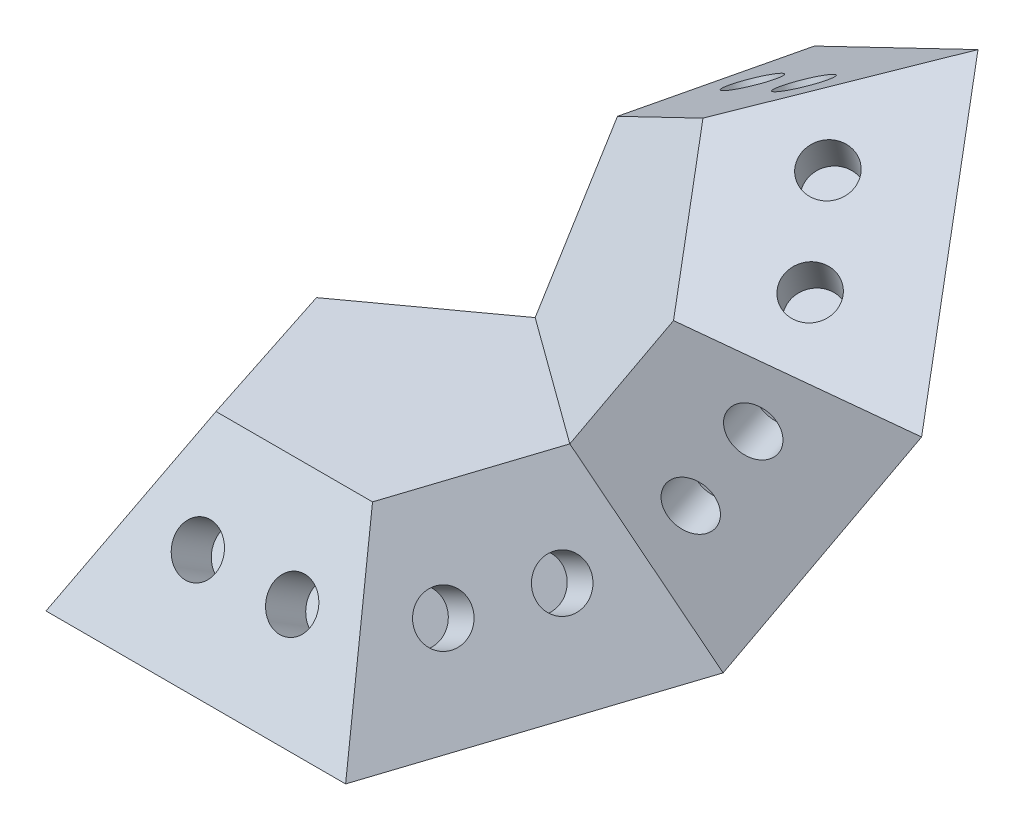
ISO-10303-21;
HEADER;
FILE_DESCRIPTION(('STEP AP214'),'2;1');
FILE_NAME('part.step','',(''),(''),'','','');
FILE_SCHEMA(('AUTOMOTIVE_DESIGN { 1 0 10303 214 1 1 1 1 }'));
ENDSEC;
DATA;
#1=APPLICATION_CONTEXT('core data for automotive mechanical design processes');
#2=APPLICATION_PROTOCOL_DEFINITION('international standard','automotive_design',2000,#1);
#3=PRODUCT_CONTEXT('',#1,'mechanical');
#4=PRODUCT('Part','Part','',(#3));
#5=PRODUCT_RELATED_PRODUCT_CATEGORY('part','',(#4));
#6=PRODUCT_DEFINITION_FORMATION('','',#4);
#7=PRODUCT_DEFINITION_CONTEXT('part definition',#1,'design');
#8=PRODUCT_DEFINITION('design','',#6,#7);
#9=PRODUCT_DEFINITION_SHAPE('','',#8);
#10=(LENGTH_UNIT() NAMED_UNIT(*) SI_UNIT(.MILLI.,.METRE.));
#11=(NAMED_UNIT(*) PLANE_ANGLE_UNIT() SI_UNIT($,.RADIAN.));
#12=(NAMED_UNIT(*) SI_UNIT($,.STERADIAN.) SOLID_ANGLE_UNIT());
#13=UNCERTAINTY_MEASURE_WITH_UNIT(LENGTH_MEASURE(1.E-05),#10,'distance_accuracy_value','');
#14=(GEOMETRIC_REPRESENTATION_CONTEXT(3) GLOBAL_UNCERTAINTY_ASSIGNED_CONTEXT((#13)) GLOBAL_UNIT_ASSIGNED_CONTEXT((#10,
#11,#12)) REPRESENTATION_CONTEXT('',''));
#15=CARTESIAN_POINT('',(0.,0.,0.));
#16=DIRECTION('',(0.,0.,1.));
#17=DIRECTION('',(1.,0.,0.));
#18=AXIS2_PLACEMENT_3D('',#15,#16,#17);
#19=CARTESIAN_POINT('',(0.,0.,-10.8032652660709));
#20=DIRECTION('',(-0.500000000000001,0.525731112119135,-0.688190960235585));
#21=DIRECTION('',(0.,0.794654472291765,0.607061998206688));
#22=AXIS2_PLACEMENT_3D('',#19,#20,#21);
#23=PLANE('',#22);
#24=CARTESIAN_POINT('',(-5.52888070660523,3.37602039564715,-4.20724821160521));
#25=DIRECTION('',(-0.499999999999997,0.525731112119135,-0.688190960235588));
#26=DIRECTION('',(-0.309016994374946,-0.850650808352039,-0.425325404176023));
#27=AXIS2_PLACEMENT_3D('',#24,#25,#26);
#28=CIRCLE('',#27,1.);
#29=CARTESIAN_POINT('',(-5.83789770098017,2.52536958729511,-4.63257361578123));
#30=VERTEX_POINT('',#29);
#31=EDGE_CURVE('E164',#30,#30,#28,.T.);
#32=ORIENTED_EDGE('',*,*,#31,.F.);
#33=EDGE_LOOP('',(#32));
#34=FACE_BOUND('',#33,.T.);
#35=CARTESIAN_POINT('',(-2.29281272910543,3.37602039564716,-6.55838922077508));
#36=DIRECTION('',(-0.499999999999997,0.525731112119135,-0.688190960235588));
#37=DIRECTION('',(-0.309016994374946,-0.850650808352039,-0.425325404176023));
#38=AXIS2_PLACEMENT_3D('',#35,#36,#37);
#39=CIRCLE('',#38,1.);
#40=CARTESIAN_POINT('',(-2.60182972348037,2.52536958729512,-6.98371462495111));
#41=VERTEX_POINT('',#40);
#42=EDGE_CURVE('E163',#41,#41,#39,.T.);
#43=ORIENTED_EDGE('',*,*,#42,.F.);
#44=EDGE_LOOP('',(#43));
#45=FACE_BOUND('',#44,.T.);
#46=DIRECTION('',(-0.577350269189627,-0.794654472291765,-0.187592474085079));
#47=VECTOR('',#46,1.);
#48=CARTESIAN_POINT('',(-10.2745158285618,0.,-3.33839256195648));
#49=LINE('',#48,#47);
#50=CARTESIAN_POINT('',(-5.36887104285956,6.75204079129431,-1.74445194835956));
#51=VERTEX_POINT('',#50);
#52=CARTESIAN_POINT('',(-10.2745158285618,0.,-3.33839256195648));
#53=VERTEX_POINT('',#52);
#54=EDGE_CURVE('E37',#51,#53,#49,.T.);
#55=ORIENTED_EDGE('',*,*,#54,.F.);
#56=DIRECTION('',(0.809016994374947,0.,-0.587785252292474));
#57=VECTOR('',#56,1.);
#58=CARTESIAN_POINT('',(-5.36887104285956,6.75204079129431,-1.74445194835956));
#59=LINE('',#58,#57);
#60=CARTESIAN_POINT('',(0.,6.75204079129431,-5.64516508837354));
#61=VERTEX_POINT('',#60);
#62=EDGE_CURVE('E133',#51,#61,#59,.T.);
#63=ORIENTED_EDGE('',*,*,#62,.T.);
#64=DIRECTION('',(0.,-0.794654472291765,-0.607061998206687));
#65=VECTOR('',#64,1.);
#66=CARTESIAN_POINT('',(0.,0.,-10.8032652660709));
#67=LINE('',#66,#65);
#68=CARTESIAN_POINT('',(0.,0.,-10.8032652660709));
#69=VERTEX_POINT('',#68);
#70=EDGE_CURVE('E11',#61,#69,#67,.T.);
#71=ORIENTED_EDGE('',*,*,#70,.T.);
#72=DIRECTION('',(-0.809016994374946,0.,0.587785252292474));
#73=VECTOR('',#72,1.);
#74=CARTESIAN_POINT('',(0.,0.,-10.8032652660709));
#75=LINE('',#74,#73);
#76=EDGE_CURVE('E201',#69,#53,#75,.T.);
#77=ORIENTED_EDGE('',*,*,#76,.T.);
#78=EDGE_LOOP('',(#55,#63,#71,#77));
#79=FACE_BOUND('',#78,.T.);
#80=ADVANCED_FACE('F34',(#34,#45,#79),#23,.T.);
#81=CARTESIAN_POINT('',(-10.2745158285618,0.,-3.33839256195648));
#82=DIRECTION('',(-0.809016994374947,0.525731112119135,0.262865556059568));
#83=DIRECTION('',(-0.544893675596393,-0.838505147446963,0.));
#84=AXIS2_PLACEMENT_3D('',#81,#82,#83);
#85=PLANE('',#84);
#86=CARTESIAN_POINT('',(-5.70984892553103,3.37602039564715,3.95816682689586));
#87=DIRECTION('',(-0.809016994374947,0.525731112119135,0.262865556059566));
#88=DIRECTION('',(-0.500000000000002,-0.850650808352039,0.162459848116452));
#89=AXIS2_PLACEMENT_3D('',#86,#87,#88);
#90=CIRCLE('',#89,1.);
#91=CARTESIAN_POINT('',(-6.20984892553104,2.52536958729511,4.12062667501231));
#92=VERTEX_POINT('',#91);
#93=EDGE_CURVE('E173',#92,#92,#90,.T.);
#94=ORIENTED_EDGE('',*,*,#93,.F.);
#95=EDGE_LOOP('',(#94));
#96=FACE_BOUND('',#95,.T.);
#97=CARTESIAN_POINT('',(-6.94591690303082,3.37602039564716,0.153940761715241));
#98=DIRECTION('',(-0.809016994374947,0.525731112119135,0.262865556059566));
#99=DIRECTION('',(-0.500000000000002,-0.850650808352039,0.162459848116452));
#100=AXIS2_PLACEMENT_3D('',#97,#98,#99);
#101=CIRCLE('',#100,1.);
#102=CARTESIAN_POINT('',(-7.44591690303082,2.52536958729512,0.316400609831693));
#103=VERTEX_POINT('',#102);
#104=EDGE_CURVE('E172',#103,#103,#101,.T.);
#105=ORIENTED_EDGE('',*,*,#104,.F.);
#106=EDGE_LOOP('',(#105));
#107=FACE_BOUND('',#106,.T.);
#108=DIRECTION('',(-0.35682208977309,-0.794654472291765,0.491123473188424));
#109=VECTOR('',#108,1.);
#110=CARTESIAN_POINT('',(-6.34999999999999,0.,8.74002519499197));
#111=LINE('',#110,#109);
#112=CARTESIAN_POINT('',(-3.3181447857023,6.75204079129431,4.56703449254633));
#113=VERTEX_POINT('',#112);
#114=CARTESIAN_POINT('',(-6.34999999999999,0.,8.74002519499197));
#115=VERTEX_POINT('',#114);
#116=EDGE_CURVE('E215',#113,#115,#111,.T.);
#117=ORIENTED_EDGE('',*,*,#116,.F.);
#118=DIRECTION('',(-0.309016994374949,0.,-0.951056516295153));
#119=VECTOR('',#118,1.);
#120=CARTESIAN_POINT('',(-3.3181447857023,6.75204079129431,4.56703449254633));
#121=LINE('',#120,#119);
#122=EDGE_CURVE('E141',#113,#51,#121,.T.);
#123=ORIENTED_EDGE('',*,*,#122,.T.);
#124=ORIENTED_EDGE('',*,*,#54,.T.);
#125=DIRECTION('',(0.309016994374949,0.,0.951056516295153));
#126=VECTOR('',#125,1.);
#127=CARTESIAN_POINT('',(-10.2745158285618,0.,-3.33839256195648));
#128=LINE('',#127,#126);
#129=EDGE_CURVE('E204',#53,#115,#128,.T.);
#130=ORIENTED_EDGE('',*,*,#129,.T.);
#131=EDGE_LOOP('',(#117,#123,#124,#130));
#132=FACE_BOUND('',#131,.T.);
#133=ADVANCED_FACE('F220',(#96,#107,#132),#85,.T.);
#134=CARTESIAN_POINT('',(-6.34999999999999,0.,8.74002519499197));
#135=DIRECTION('',(0.,0.525731112119135,0.850650808352039));
#136=DIRECTION('',(0.,-0.850650808352039,0.525731112119135));
#137=AXIS2_PLACEMENT_3D('',#134,#135,#136);
#138=PLANE('',#137);
#139=CARTESIAN_POINT('',(-1.99999999999999,3.37602039564716,6.65352984376915));
#140=DIRECTION('',(0.,0.525731112119135,0.850650808352039));
#141=DIRECTION('',(0.,-0.850650808352039,0.525731112119135));
#142=AXIS2_PLACEMENT_3D('',#139,#140,#141);
#143=CIRCLE('',#142,1.);
#144=CARTESIAN_POINT('',(-1.99999999999999,2.52536958729512,7.17926095588829));
#145=VERTEX_POINT('',#144);
#146=EDGE_CURVE('E191',#145,#145,#143,.T.);
#147=ORIENTED_EDGE('',*,*,#146,.F.);
#148=EDGE_LOOP('',(#147));
#149=FACE_BOUND('',#148,.T.);
#150=CARTESIAN_POINT('',(2.00000000000001,3.37602039564715,6.65352984376915));
#151=DIRECTION('',(0.,0.525731112119135,0.850650808352039));
#152=DIRECTION('',(0.,-0.850650808352039,0.525731112119135));
#153=AXIS2_PLACEMENT_3D('',#150,#151,#152);
#154=CIRCLE('',#153,1.);
#155=CARTESIAN_POINT('',(2.00000000000001,2.52536958729511,7.17926095588828));
#156=VERTEX_POINT('',#155);
#157=EDGE_CURVE('E184',#156,#156,#154,.T.);
#158=ORIENTED_EDGE('',*,*,#157,.F.);
#159=EDGE_LOOP('',(#158));
#160=FACE_BOUND('',#159,.T.);
#161=DIRECTION('',(0.356822089773091,-0.794654472291765,0.491123473188423));
#162=VECTOR('',#161,1.);
#163=CARTESIAN_POINT('',(6.35000000000002,0.,8.74002519499195));
#164=LINE('',#163,#162);
#165=CARTESIAN_POINT('',(3.31814478570229,6.75204079129431,4.56703449254632));
#166=VERTEX_POINT('',#165);
#167=CARTESIAN_POINT('',(6.35000000000002,0.,8.74002519499195));
#168=VERTEX_POINT('',#167);
#169=EDGE_CURVE('E214',#166,#168,#164,.T.);
#170=ORIENTED_EDGE('',*,*,#169,.F.);
#171=DIRECTION('',(-1.,0.,0.));
#172=VECTOR('',#171,1.);
#173=CARTESIAN_POINT('',(3.31814478570231,6.75204079129431,4.56703449254633));
#174=LINE('',#173,#172);
#175=EDGE_CURVE('E50',#166,#113,#174,.T.);
#176=ORIENTED_EDGE('',*,*,#175,.T.);
#177=ORIENTED_EDGE('',*,*,#116,.T.);
#178=DIRECTION('',(1.,0.,0.));
#179=VECTOR('',#178,1.);
#180=CARTESIAN_POINT('',(-6.34999999999999,0.,8.74002519499197));
#181=LINE('',#180,#179);
#182=EDGE_CURVE('E207',#115,#168,#181,.T.);
#183=ORIENTED_EDGE('',*,*,#182,.T.);
#184=EDGE_LOOP('',(#170,#176,#177,#183));
#185=FACE_BOUND('',#184,.T.);
#186=ADVANCED_FACE('F228',(#149,#160,#185),#138,.T.);
#187=CARTESIAN_POINT('',(6.35000000000002,0.,8.74002519499195));
#188=DIRECTION('',(0.809016994374947,0.525731112119135,0.262865556059565));
#189=DIRECTION('',(-0.544893675596392,0.838505147446963,0.));
#190=AXIS2_PLACEMENT_3D('',#187,#188,#189);
#191=PLANE('',#190);
#192=CARTESIAN_POINT('',(6.94591690303082,3.37602039564715,0.153940761715315));
#193=DIRECTION('',(0.809016994374944,0.525731112119135,0.262865556059574));
#194=DIRECTION('',(0.499999999999999,-0.850650808352039,0.162459848116459));
#195=AXIS2_PLACEMENT_3D('',#192,#193,#194);
#196=CIRCLE('',#195,1.);
#197=CARTESIAN_POINT('',(7.44591690303082,2.52536958729511,0.316400609831774));
#198=VERTEX_POINT('',#197);
#199=EDGE_CURVE('E144',#198,#198,#196,.T.);
#200=ORIENTED_EDGE('',*,*,#199,.F.);
#201=EDGE_LOOP('',(#200));
#202=FACE_BOUND('',#201,.T.);
#203=CARTESIAN_POINT('',(5.70984892553099,3.37602039564716,3.95816682689592));
#204=DIRECTION('',(0.809016994374944,0.525731112119135,0.262865556059574));
#205=DIRECTION('',(0.499999999999999,-0.850650808352039,0.162459848116459));
#206=AXIS2_PLACEMENT_3D('',#203,#204,#205);
#207=CIRCLE('',#206,1.);
#208=CARTESIAN_POINT('',(6.20984892553099,2.52536958729512,4.12062667501238));
#209=VERTEX_POINT('',#208);
#210=EDGE_CURVE('E148',#209,#209,#207,.T.);
#211=ORIENTED_EDGE('',*,*,#210,.F.);
#212=EDGE_LOOP('',(#211));
#213=FACE_BOUND('',#212,.T.);
#214=DIRECTION('',(0.577350269189626,-0.794654472291765,-0.187592474085081));
#215=VECTOR('',#214,1.);
#216=CARTESIAN_POINT('',(10.2745158285618,0.,-3.33839256195651));
#217=LINE('',#216,#215);
#218=CARTESIAN_POINT('',(5.36887104285952,6.75204079129429,-1.74445194835959));
#219=VERTEX_POINT('',#218);
#220=CARTESIAN_POINT('',(10.2745158285618,0.,-3.33839256195651));
#221=VERTEX_POINT('',#220);
#222=EDGE_CURVE('E210',#219,#221,#217,.T.);
#223=ORIENTED_EDGE('',*,*,#222,.F.);
#224=DIRECTION('',(-0.309016994374946,0.,0.951056516295154));
#225=VECTOR('',#224,1.);
#226=CARTESIAN_POINT('',(5.36887104285956,6.75204079129431,-1.74445194835958));
#227=LINE('',#226,#225);
#228=EDGE_CURVE('E138',#219,#166,#227,.T.);
#229=ORIENTED_EDGE('',*,*,#228,.T.);
#230=ORIENTED_EDGE('',*,*,#169,.T.);
#231=DIRECTION('',(0.309016994374946,0.,-0.951056516295154));
#232=VECTOR('',#231,1.);
#233=CARTESIAN_POINT('',(6.35000000000002,0.,8.74002519499195));
#234=LINE('',#233,#232);
#235=EDGE_CURVE('E58',#168,#221,#234,.T.);
#236=ORIENTED_EDGE('',*,*,#235,.T.);
#237=EDGE_LOOP('',(#223,#229,#230,#236));
#238=FACE_BOUND('',#237,.T.);
#239=ADVANCED_FACE('F229',(#202,#213,#238),#191,.T.);
#240=CARTESIAN_POINT('',(0.,0.,0.));
#241=DIRECTION('',(0.,1.,0.));
#242=DIRECTION('',(0.,0.,1.));
#243=AXIS2_PLACEMENT_3D('',#240,#241,#242);
#244=PLANE('',#243);
#245=DIRECTION('',(-0.809016994374948,0.,-0.587785252292472));
#246=VECTOR('',#245,1.);
#247=CARTESIAN_POINT('',(10.2745158285618,0.,-3.33839256195651));
#248=LINE('',#247,#246);
#249=EDGE_CURVE('E190',#221,#69,#248,.T.);
#250=ORIENTED_EDGE('',*,*,#249,.F.);
#251=ORIENTED_EDGE('',*,*,#235,.F.);
#252=ORIENTED_EDGE('',*,*,#182,.F.);
#253=ORIENTED_EDGE('',*,*,#129,.F.);
#254=ORIENTED_EDGE('',*,*,#76,.F.);
#255=EDGE_LOOP('',(#250,#251,#252,#253,#254));
#256=FACE_BOUND('',#255,.T.);
#257=ADVANCED_FACE('F226',(#256),#244,.F.);
#258=CARTESIAN_POINT('',(2.00000000000001,2.32455817140888,4.95222822706507));
#259=DIRECTION('',(0.,0.525731112119135,0.850650808352039));
#260=DIRECTION('',(0.,-0.850650808352039,0.525731112119135));
#261=AXIS2_PLACEMENT_3D('',#258,#259,#260);
#262=CYLINDRICAL_SURFACE('',#261,1.);
#263=CARTESIAN_POINT('',(2.00000000000001,2.32455817140888,4.95222822706507));
#264=DIRECTION('',(0.,0.525731112119135,0.850650808352039));
#265=DIRECTION('',(0.,-0.850650808352039,0.525731112119135));
#266=AXIS2_PLACEMENT_3D('',#263,#264,#265);
#267=CIRCLE('',#266,1.);
#268=CARTESIAN_POINT('',(2.00000000000001,1.47390736305684,5.4779593391842));
#269=VERTEX_POINT('',#268);
#270=EDGE_CURVE('E194',#269,#269,#267,.T.);
#271=ORIENTED_EDGE('',*,*,#270,.F.);
#272=EDGE_LOOP('',(#271));
#273=FACE_BOUND('',#272,.T.);
#274=ORIENTED_EDGE('',*,*,#157,.T.);
#275=EDGE_LOOP('',(#274));
#276=FACE_BOUND('',#275,.T.);
#277=ADVANCED_FACE('F378',(#273,#276),#262,.F.);
#278=CARTESIAN_POINT('',(2.00000000000001,2.32455817140888,4.95222822706507));
#279=DIRECTION('',(0.,0.525731112119135,0.850650808352039));
#280=DIRECTION('',(0.,-0.850650808352039,0.525731112119135));
#281=AXIS2_PLACEMENT_3D('',#278,#279,#280);
#282=PLANE('',#281);
#283=ORIENTED_EDGE('',*,*,#270,.T.);
#284=EDGE_LOOP('',(#283));
#285=FACE_BOUND('',#284,.T.);
#286=ADVANCED_FACE('F374',(#285),#282,.T.);
#287=CARTESIAN_POINT('',(-1.99999999999999,2.32455817140889,4.95222822706507));
#288=DIRECTION('',(0.,0.525731112119135,0.850650808352039));
#289=DIRECTION('',(0.,-0.850650808352039,0.525731112119135));
#290=AXIS2_PLACEMENT_3D('',#287,#288,#289);
#291=CYLINDRICAL_SURFACE('',#290,1.);
#292=CARTESIAN_POINT('',(-1.99999999999999,2.32455817140889,4.95222822706507));
#293=DIRECTION('',(0.,0.525731112119135,0.850650808352039));
#294=DIRECTION('',(0.,-0.850650808352039,0.525731112119135));
#295=AXIS2_PLACEMENT_3D('',#292,#293,#294);
#296=CIRCLE('',#295,1.);
#297=CARTESIAN_POINT('',(-1.99999999999999,1.47390736305685,5.47795933918421));
#298=VERTEX_POINT('',#297);
#299=EDGE_CURVE('E187',#298,#298,#296,.T.);
#300=ORIENTED_EDGE('',*,*,#299,.F.);
#301=EDGE_LOOP('',(#300));
#302=FACE_BOUND('',#301,.T.);
#303=ORIENTED_EDGE('',*,*,#146,.T.);
#304=EDGE_LOOP('',(#303));
#305=FACE_BOUND('',#304,.T.);
#306=ADVANCED_FACE('F370',(#302,#305),#291,.F.);
#307=CARTESIAN_POINT('',(-1.99999999999999,2.32455817140889,4.95222822706507));
#308=DIRECTION('',(0.,0.525731112119135,0.850650808352039));
#309=DIRECTION('',(0.,-0.850650808352039,0.525731112119135));
#310=AXIS2_PLACEMENT_3D('',#307,#308,#309);
#311=PLANE('',#310);
#312=ORIENTED_EDGE('',*,*,#299,.T.);
#313=EDGE_LOOP('',(#312));
#314=FACE_BOUND('',#313,.T.);
#315=ADVANCED_FACE('F366',(#314),#311,.T.);
#316=CARTESIAN_POINT('',(4.0918149367811,2.32455817140889,3.43243571477677));
#317=DIRECTION('',(0.809016994374944,0.525731112119135,0.262865556059574));
#318=DIRECTION('',(-0.544893675596394,0.838505147446962,0.));
#319=AXIS2_PLACEMENT_3D('',#316,#317,#318);
#320=CYLINDRICAL_SURFACE('',#319,1.);
#321=CARTESIAN_POINT('',(4.0918149367811,2.32455817140889,3.43243571477677));
#322=DIRECTION('',(0.809016994374944,0.525731112119135,0.262865556059574));
#323=DIRECTION('',(0.499999999999999,-0.850650808352039,0.162459848116459));
#324=AXIS2_PLACEMENT_3D('',#321,#322,#323);
#325=CIRCLE('',#324,1.);
#326=CARTESIAN_POINT('',(4.5918149367811,1.47390736305685,3.59489556289323));
#327=VERTEX_POINT('',#326);
#328=EDGE_CURVE('E155',#327,#327,#325,.T.);
#329=ORIENTED_EDGE('',*,*,#328,.F.);
#330=EDGE_LOOP('',(#329));
#331=FACE_BOUND('',#330,.T.);
#332=ORIENTED_EDGE('',*,*,#210,.T.);
#333=EDGE_LOOP('',(#332));
#334=FACE_BOUND('',#333,.T.);
#335=ADVANCED_FACE('F369',(#331,#334),#320,.F.);
#336=CARTESIAN_POINT('',(4.0918149367811,2.32455817140889,3.43243571477677));
#337=DIRECTION('',(0.809016994374944,0.525731112119135,0.262865556059574));
#338=DIRECTION('',(0.499999999999999,-0.850650808352039,0.162459848116459));
#339=AXIS2_PLACEMENT_3D('',#336,#337,#338);
#340=PLANE('',#339);
#341=ORIENTED_EDGE('',*,*,#328,.T.);
#342=EDGE_LOOP('',(#341));
#343=FACE_BOUND('',#342,.T.);
#344=ADVANCED_FACE('F693',(#343),#340,.T.);
#345=CARTESIAN_POINT('',(5.32788291428093,2.32455817140888,-0.371790350403834));
#346=DIRECTION('',(0.809016994374944,0.525731112119135,0.262865556059574));
#347=DIRECTION('',(-0.544893675596394,0.838505147446962,0.));
#348=AXIS2_PLACEMENT_3D('',#345,#346,#347);
#349=CYLINDRICAL_SURFACE('',#348,1.);
#350=CARTESIAN_POINT('',(5.32788291428093,2.32455817140888,-0.371790350403834));
#351=DIRECTION('',(0.809016994374944,0.525731112119135,0.262865556059574));
#352=DIRECTION('',(0.499999999999999,-0.850650808352039,0.162459848116459));
#353=AXIS2_PLACEMENT_3D('',#350,#351,#352);
#354=CIRCLE('',#353,1.);
#355=CARTESIAN_POINT('',(5.82788291428093,1.47390736305684,-0.209330502287375));
#356=VERTEX_POINT('',#355);
#357=EDGE_CURVE('E145',#356,#356,#354,.T.);
#358=ORIENTED_EDGE('',*,*,#357,.F.);
#359=EDGE_LOOP('',(#358));
#360=FACE_BOUND('',#359,.T.);
#361=ORIENTED_EDGE('',*,*,#199,.T.);
#362=EDGE_LOOP('',(#361));
#363=FACE_BOUND('',#362,.T.);
#364=ADVANCED_FACE('F702',(#360,#363),#349,.F.);
#365=CARTESIAN_POINT('',(5.32788291428093,2.32455817140888,-0.371790350403834));
#366=DIRECTION('',(0.809016994374944,0.525731112119135,0.262865556059574));
#367=DIRECTION('',(0.499999999999999,-0.850650808352039,0.162459848116459));
#368=AXIS2_PLACEMENT_3D('',#365,#366,#367);
#369=PLANE('',#368);
#370=ORIENTED_EDGE('',*,*,#357,.T.);
#371=EDGE_LOOP('',(#370));
#372=FACE_BOUND('',#371,.T.);
#373=ADVANCED_FACE('F364',(#372),#369,.T.);
#374=CARTESIAN_POINT('',(-5.32788291428092,2.32455817140889,-0.371790350403891));
#375=DIRECTION('',(-0.809016994374947,0.525731112119135,0.262865556059566));
#376=DIRECTION('',(-0.544893675596393,-0.838505147446963,0.));
#377=AXIS2_PLACEMENT_3D('',#374,#375,#376);
#378=CYLINDRICAL_SURFACE('',#377,1.);
#379=CARTESIAN_POINT('',(-5.32788291428092,2.32455817140889,-0.371790350403891));
#380=DIRECTION('',(-0.809016994374947,0.525731112119135,0.262865556059566));
#381=DIRECTION('',(-0.500000000000002,-0.850650808352039,0.162459848116452));
#382=AXIS2_PLACEMENT_3D('',#379,#380,#381);
#383=CIRCLE('',#382,1.);
#384=CARTESIAN_POINT('',(-5.82788291428093,1.47390736305685,-0.209330502287439));
#385=VERTEX_POINT('',#384);
#386=EDGE_CURVE('E181',#385,#385,#383,.T.);
#387=ORIENTED_EDGE('',*,*,#386,.F.);
#388=EDGE_LOOP('',(#387));
#389=FACE_BOUND('',#388,.T.);
#390=ORIENTED_EDGE('',*,*,#104,.T.);
#391=EDGE_LOOP('',(#390));
#392=FACE_BOUND('',#391,.T.);
#393=ADVANCED_FACE('F360',(#389,#392),#378,.F.);
#394=CARTESIAN_POINT('',(-5.32788291428092,2.32455817140889,-0.371790350403891));
#395=DIRECTION('',(-0.809016994374947,0.525731112119135,0.262865556059566));
#396=DIRECTION('',(-0.500000000000002,-0.850650808352039,0.162459848116452));
#397=AXIS2_PLACEMENT_3D('',#394,#395,#396);
#398=PLANE('',#397);
#399=ORIENTED_EDGE('',*,*,#386,.T.);
#400=EDGE_LOOP('',(#399));
#401=FACE_BOUND('',#400,.T.);
#402=ADVANCED_FACE('F357',(#401),#398,.T.);
#403=CARTESIAN_POINT('',(-4.09181493678114,2.32455817140888,3.43243571477673));
#404=DIRECTION('',(-0.809016994374947,0.525731112119135,0.262865556059566));
#405=DIRECTION('',(-0.544893675596393,-0.838505147446963,0.));
#406=AXIS2_PLACEMENT_3D('',#403,#404,#405);
#407=CYLINDRICAL_SURFACE('',#406,1.);
#408=CARTESIAN_POINT('',(-4.09181493678114,2.32455817140888,3.43243571477673));
#409=DIRECTION('',(-0.809016994374947,0.525731112119135,0.262865556059566));
#410=DIRECTION('',(-0.500000000000002,-0.850650808352039,0.162459848116452));
#411=AXIS2_PLACEMENT_3D('',#408,#409,#410);
#412=CIRCLE('',#411,1.);
#413=CARTESIAN_POINT('',(-4.59181493678114,1.47390736305684,3.59489556289318));
#414=VERTEX_POINT('',#413);
#415=EDGE_CURVE('E169',#414,#414,#412,.T.);
#416=ORIENTED_EDGE('',*,*,#415,.F.);
#417=EDGE_LOOP('',(#416));
#418=FACE_BOUND('',#417,.T.);
#419=ORIENTED_EDGE('',*,*,#93,.T.);
#420=EDGE_LOOP('',(#419));
#421=FACE_BOUND('',#420,.T.);
#422=ADVANCED_FACE('F351',(#418,#421),#407,.F.);
#423=CARTESIAN_POINT('',(-4.09181493678114,2.32455817140888,3.43243571477673));
#424=DIRECTION('',(-0.809016994374947,0.525731112119135,0.262865556059566));
#425=DIRECTION('',(-0.500000000000002,-0.850650808352039,0.162459848116452));
#426=AXIS2_PLACEMENT_3D('',#423,#424,#425);
#427=PLANE('',#426);
#428=ORIENTED_EDGE('',*,*,#415,.T.);
#429=EDGE_LOOP('',(#428));
#430=FACE_BOUND('',#429,.T.);
#431=ADVANCED_FACE('F341',(#430),#427,.T.);
#432=CARTESIAN_POINT('',(-1.29281272910543,2.32455817140889,-5.18200730030391));
#433=DIRECTION('',(-0.499999999999997,0.525731112119135,-0.688190960235588));
#434=DIRECTION('',(0.,0.794654472291766,0.607061998206686));
#435=AXIS2_PLACEMENT_3D('',#432,#433,#434);
#436=CYLINDRICAL_SURFACE('',#435,1.);
#437=CARTESIAN_POINT('',(-1.29281272910543,2.32455817140889,-5.18200730030391));
#438=DIRECTION('',(-0.499999999999997,0.525731112119135,-0.688190960235588));
#439=DIRECTION('',(-0.309016994374946,-0.850650808352039,-0.425325404176023));
#440=AXIS2_PLACEMENT_3D('',#437,#438,#439);
#441=CIRCLE('',#440,1.);
#442=CARTESIAN_POINT('',(-1.60182972348038,1.47390736305685,-5.60733270447993));
#443=VERTEX_POINT('',#442);
#444=EDGE_CURVE('E176',#443,#443,#441,.T.);
#445=ORIENTED_EDGE('',*,*,#444,.F.);
#446=EDGE_LOOP('',(#445));
#447=FACE_BOUND('',#446,.T.);
#448=ORIENTED_EDGE('',*,*,#42,.T.);
#449=EDGE_LOOP('',(#448));
#450=FACE_BOUND('',#449,.T.);
#451=ADVANCED_FACE('F338',(#447,#450),#436,.F.);
#452=CARTESIAN_POINT('',(-1.29281272910543,2.32455817140889,-5.18200730030391));
#453=DIRECTION('',(-0.499999999999997,0.525731112119135,-0.688190960235588));
#454=DIRECTION('',(-0.309016994374946,-0.850650808352039,-0.425325404176023));
#455=AXIS2_PLACEMENT_3D('',#452,#453,#454);
#456=PLANE('',#455);
#457=ORIENTED_EDGE('',*,*,#444,.T.);
#458=EDGE_LOOP('',(#457));
#459=FACE_BOUND('',#458,.T.);
#460=ADVANCED_FACE('F340',(#459),#456,.T.);
#461=CARTESIAN_POINT('',(-4.52888070660523,2.32455817140888,-2.83086629113403));
#462=DIRECTION('',(-0.499999999999997,0.525731112119135,-0.688190960235588));
#463=DIRECTION('',(0.,0.794654472291766,0.607061998206686));
#464=AXIS2_PLACEMENT_3D('',#461,#462,#463);
#465=CYLINDRICAL_SURFACE('',#464,1.);
#466=CARTESIAN_POINT('',(-4.52888070660523,2.32455817140888,-2.83086629113403));
#467=DIRECTION('',(-0.499999999999997,0.525731112119135,-0.688190960235588));
#468=DIRECTION('',(-0.309016994374946,-0.850650808352039,-0.425325404176023));
#469=AXIS2_PLACEMENT_3D('',#466,#467,#468);
#470=CIRCLE('',#469,1.);
#471=CARTESIAN_POINT('',(-4.83789770098018,1.47390736305684,-3.25619169531005));
#472=VERTEX_POINT('',#471);
#473=EDGE_CURVE('E160',#472,#472,#470,.T.);
#474=ORIENTED_EDGE('',*,*,#473,.F.);
#475=EDGE_LOOP('',(#474));
#476=FACE_BOUND('',#475,.T.);
#477=ORIENTED_EDGE('',*,*,#31,.T.);
#478=EDGE_LOOP('',(#477));
#479=FACE_BOUND('',#478,.T.);
#480=ADVANCED_FACE('F348',(#476,#479),#465,.F.);
#481=CARTESIAN_POINT('',(-4.52888070660523,2.32455817140888,-2.83086629113403));
#482=DIRECTION('',(-0.499999999999997,0.525731112119135,-0.688190960235588));
#483=DIRECTION('',(-0.309016994374946,-0.850650808352039,-0.425325404176023));
#484=AXIS2_PLACEMENT_3D('',#481,#482,#483);
#485=PLANE('',#484);
#486=ORIENTED_EDGE('',*,*,#473,.T.);
#487=EDGE_LOOP('',(#486));
#488=FACE_BOUND('',#487,.T.);
#489=ADVANCED_FACE('F650',(#488),#485,.T.);
#490=CARTESIAN_POINT('',(0.,6.75204079129431,0.));
#491=DIRECTION('',(0.,-1.,0.));
#492=DIRECTION('',(0.,0.,-1.));
#493=AXIS2_PLACEMENT_3D('',#490,#491,#492);
#494=PLANE('',#493);
#495=ORIENTED_EDGE('',*,*,#62,.F.);
#496=ORIENTED_EDGE('',*,*,#122,.F.);
#497=ORIENTED_EDGE('',*,*,#175,.F.);
#498=ORIENTED_EDGE('',*,*,#228,.F.);
#499=DIRECTION('',(0.809016994374948,0.,0.587785252292472));
#500=VECTOR('',#499,1.);
#501=CARTESIAN_POINT('',(0.,6.75204079129431,-5.64516508837354));
#502=LINE('',#501,#500);
#503=EDGE_CURVE('E136',#61,#219,#502,.T.);
#504=ORIENTED_EDGE('',*,*,#503,.F.);
#505=EDGE_LOOP('',(#495,#496,#497,#498,#504));
#506=FACE_BOUND('',#505,.T.);
#507=ADVANCED_FACE('F230',(#506),#494,.F.);
#508=CARTESIAN_POINT('',(7.43470949713708,7.81731618442516,-10.2329997358148));
#509=DIRECTION('',(-0.525731112119133,0.447213595499956,0.723606797749981));
#510=DIRECTION('',(0.688190960235585,0.723606797749981,0.0527864045000414));
#511=AXIS2_PLACEMENT_3D('',#508,#509,#510);
#512=PLANE('',#511);
#513=ORIENTED_EDGE('',*,*,#249,.T.);
#514=DIRECTION('',(0.,0.850650808352041,-0.525731112119132));
#515=VECTOR('',#514,1.);
#516=CARTESIAN_POINT('',(0.,0.,-10.8032652660709));
#517=LINE('',#516,#515);
#518=CARTESIAN_POINT('',(0.,10.8032652660709,-17.4800503899839));
#519=VERTEX_POINT('',#518);
#520=EDGE_CURVE('E125',#69,#519,#517,.T.);
#521=ORIENTED_EDGE('',*,*,#520,.T.);
#522=DIRECTION('',(0.809016994374947,0.525731112119134,0.262865556059567));
#523=VECTOR('',#522,1.);
#524=CARTESIAN_POINT('',(0.,10.8032652660709,-17.4800503899839));
#525=LINE('',#524,#523);
#526=CARTESIAN_POINT('',(10.2745158285618,17.4800503899839,-14.1416578280274));
#527=VERTEX_POINT('',#526);
#528=EDGE_CURVE('E122',#519,#527,#525,.T.);
#529=ORIENTED_EDGE('',*,*,#528,.T.);
#530=DIRECTION('',(0.500000000000001,-0.525731112119134,0.688190960235585));
#531=VECTOR('',#530,1.);
#532=CARTESIAN_POINT('',(10.2745158285618,17.4800503899839,-14.1416578280274));
#533=LINE('',#532,#531);
#534=CARTESIAN_POINT('',(16.6245158285618,10.8032652660709,-5.40163263303546));
#535=VERTEX_POINT('',#534);
#536=EDGE_CURVE('E298',#527,#535,#533,.T.);
#537=ORIENTED_EDGE('',*,*,#536,.T.);
#538=DIRECTION('',(-0.499999999999999,-0.850650808352041,0.162459848116452));
#539=VECTOR('',#538,1.);
#540=CARTESIAN_POINT('',(16.6245158285618,10.8032652660709,-5.40163263303546));
#541=LINE('',#540,#539);
#542=EDGE_CURVE('E288',#535,#221,#541,.T.);
#543=ORIENTED_EDGE('',*,*,#542,.T.);
#544=EDGE_LOOP('',(#513,#521,#529,#537,#543));
#545=FACE_BOUND('',#544,.T.);
#546=ADVANCED_FACE('F301',(#545),#512,.F.);
#547=CARTESIAN_POINT('',(0.,0.,-10.8032652660709));
#548=DIRECTION('',(-1.,0.,0.));
#549=DIRECTION('',(0.,0.,1.));
#550=AXIS2_PLACEMENT_3D('',#547,#548,#549);
#551=PLANE('',#550);
#552=DIRECTION('',(0.,0.850650808352042,-0.52573111211913));
#553=VECTOR('',#552,1.);
#554=CARTESIAN_POINT('',(0.,6.75204079129434,-5.64516508837356));
#555=LINE('',#554,#553);
#556=CARTESIAN_POINT('',(0.,12.3972058796678,-9.13406898509265));
#557=VERTEX_POINT('',#556);
#558=EDGE_CURVE('E103',#61,#557,#555,.T.);
#559=ORIENTED_EDGE('',*,*,#558,.T.);
#560=DIRECTION('',(0.,-0.187592474085077,-0.982246946376847));
#561=VECTOR('',#560,1.);
#562=CARTESIAN_POINT('',(0.,11.6533669266559,-13.0288603073752));
#563=LINE('',#562,#561);
#564=EDGE_CURVE('E116',#557,#519,#563,.T.);
#565=ORIENTED_EDGE('',*,*,#564,.T.);
#566=ORIENTED_EDGE('',*,*,#520,.F.);
#567=ORIENTED_EDGE('',*,*,#70,.F.);
#568=EDGE_LOOP('',(#559,#565,#566,#567));
#569=FACE_BOUND('',#568,.T.);
#570=CARTESIAN_POINT('',(0.,9.18942960096231,-11.8170996566185));
#571=DIRECTION('',(1.,0.,0.));
#572=DIRECTION('',(0.,-0.525731112119135,-0.850650808352039));
#573=AXIS2_PLACEMENT_3D('',#570,#571,#572);
#574=CIRCLE('',#573,1.);
#575=CARTESIAN_POINT('',(0.,8.66369848884318,-12.6677504649705));
#576=VERTEX_POINT('',#575);
#577=EDGE_CURVE('E262',#576,#576,#574,.T.);
#578=ORIENTED_EDGE('',*,*,#577,.T.);
#579=EDGE_LOOP('',(#578));
#580=FACE_BOUND('',#579,.T.);
#581=CARTESIAN_POINT('',(0.,5.78682636755416,-9.71417520814195));
#582=DIRECTION('',(1.,0.,0.));
#583=DIRECTION('',(0.,-0.525731112119135,-0.850650808352039));
#584=AXIS2_PLACEMENT_3D('',#581,#582,#583);
#585=CIRCLE('',#584,1.);
#586=CARTESIAN_POINT('',(0.,5.26109525543502,-10.564826016494));
#587=VERTEX_POINT('',#586);
#588=EDGE_CURVE('E261',#587,#587,#585,.T.);
#589=ORIENTED_EDGE('',*,*,#588,.T.);
#590=EDGE_LOOP('',(#589));
#591=FACE_BOUND('',#590,.T.);
#592=ADVANCED_FACE('F113',(#569,#580,#591),#551,.T.);
#593=CARTESIAN_POINT('',(0.,10.8032652660709,-17.4800503899839));
#594=DIRECTION('',(-0.500000000000002,0.85065080835204,-0.16245984811645));
#595=DIRECTION('',(-0.862103722396975,-0.506731853971388,0.));
#596=AXIS2_PLACEMENT_3D('',#593,#594,#595);
#597=PLANE('',#596);
#598=DIRECTION('',(0.809016994374947,0.525731112119133,0.262865556059568));
#599=VECTOR('',#598,1.);
#600=CARTESIAN_POINT('',(0.,12.3972058796678,-9.13406898509265));
#601=LINE('',#600,#599);
#602=CARTESIAN_POINT('',(5.36887104285953,15.886109776387,-7.38961703673307));
#603=VERTEX_POINT('',#602);
#604=EDGE_CURVE('E100',#557,#603,#601,.T.);
#605=ORIENTED_EDGE('',*,*,#604,.T.);
#606=DIRECTION('',(0.577350269189625,0.187592474085084,-0.794654472291766));
#607=VECTOR('',#606,1.);
#608=CARTESIAN_POINT('',(7.65817194285391,16.6299487293989,-10.5405694060037));
#609=LINE('',#608,#607);
#610=EDGE_CURVE('E124',#603,#527,#609,.T.);
#611=ORIENTED_EDGE('',*,*,#610,.T.);
#612=ORIENTED_EDGE('',*,*,#528,.F.);
#613=ORIENTED_EDGE('',*,*,#564,.F.);
#614=EDGE_LOOP('',(#605,#611,#612,#613));
#615=FACE_BOUND('',#614,.T.);
#616=CARTESIAN_POINT('',(2.2928127291054,13.0901956037891,-12.5620796720784));
#617=DIRECTION('',(0.500000000000004,-0.850650808352039,0.16245984811645));
#618=DIRECTION('',(0.309016994374944,0.,-0.951056516295155));
#619=AXIS2_PLACEMENT_3D('',#616,#617,#618);
#620=CIRCLE('',#619,1.);
#621=CARTESIAN_POINT('',(2.60182972348035,13.0901956037891,-13.5131361883735));
#622=VERTEX_POINT('',#621);
#623=EDGE_CURVE('E270',#622,#622,#620,.T.);
#624=ORIENTED_EDGE('',*,*,#623,.T.);
#625=EDGE_LOOP('',(#624));
#626=FACE_BOUND('',#625,.T.);
#627=CARTESIAN_POINT('',(5.52888070660519,15.1931200522657,-11.5106174478401));
#628=DIRECTION('',(0.500000000000004,-0.850650808352039,0.16245984811645));
#629=DIRECTION('',(0.309016994374944,0.,-0.951056516295155));
#630=AXIS2_PLACEMENT_3D('',#627,#628,#629);
#631=CIRCLE('',#630,1.);
#632=CARTESIAN_POINT('',(5.83789770098013,15.1931200522657,-12.4616739641353));
#633=VERTEX_POINT('',#632);
#634=EDGE_CURVE('E271',#633,#633,#631,.T.);
#635=ORIENTED_EDGE('',*,*,#634,.T.);
#636=EDGE_LOOP('',(#635));
#637=FACE_BOUND('',#636,.T.);
#638=ADVANCED_FACE('F119',(#615,#626,#637),#597,.T.);
#639=CARTESIAN_POINT('',(10.2745158285618,17.4800503899839,-14.1416578280274));
#640=DIRECTION('',(0.309016994374946,0.850650808352039,0.425325404176022));
#641=DIRECTION('',(0.,-0.44721359549996,0.894427190999915));
#642=AXIS2_PLACEMENT_3D('',#639,#640,#641);
#643=PLANE('',#642);
#644=DIRECTION('',(0.5,-0.525731112119136,0.688190960235585));
#645=VECTOR('',#644,1.);
#646=CARTESIAN_POINT('',(5.36887104285953,15.886109776387,-7.38961703673307));
#647=LINE('',#646,#645);
#648=CARTESIAN_POINT('',(8.68701582856181,12.3972058796678,-2.82258254418676));
#649=VERTEX_POINT('',#648);
#650=EDGE_CURVE('E106',#603,#649,#647,.T.);
#651=ORIENTED_EDGE('',*,*,#650,.T.);
#652=DIRECTION('',(0.934172358962716,-0.187592474085077,-0.303530999103344));
#653=VECTOR('',#652,1.);
#654=CARTESIAN_POINT('',(12.3911824952285,11.6533669266559,-4.02613925231615));
#655=LINE('',#654,#653);
#656=EDGE_CURVE('E127',#649,#535,#655,.T.);
#657=ORIENTED_EDGE('',*,*,#656,.T.);
#658=ORIENTED_EDGE('',*,*,#536,.F.);
#659=ORIENTED_EDGE('',*,*,#610,.F.);
#660=EDGE_LOOP('',(#651,#657,#658,#659));
#661=FACE_BOUND('',#660,.T.);
#662=CARTESIAN_POINT('',(9.23872963213624,15.1931200522657,-8.81525443096684));
#663=DIRECTION('',(-0.309016994374946,-0.850650808352039,-0.425325404176022));
#664=DIRECTION('',(0.809016994374947,0.,-0.587785252292474));
#665=AXIS2_PLACEMENT_3D('',#662,#663,#664);
#666=CIRCLE('',#665,1.);
#667=CARTESIAN_POINT('',(10.0477466265112,15.1931200522657,-9.40303968325931));
#668=VERTEX_POINT('',#667);
#669=EDGE_CURVE('E289',#668,#668,#666,.T.);
#670=ORIENTED_EDGE('',*,*,#669,.T.);
#671=EDGE_LOOP('',(#670));
#672=FACE_BOUND('',#671,.T.);
#673=CARTESIAN_POINT('',(11.2387296321362,13.0901956037891,-6.0624905900245));
#674=DIRECTION('',(-0.309016994374946,-0.850650808352039,-0.425325404176022));
#675=DIRECTION('',(0.809016994374947,0.,-0.587785252292474));
#676=AXIS2_PLACEMENT_3D('',#673,#674,#675);
#677=CIRCLE('',#676,1.);
#678=CARTESIAN_POINT('',(12.0477466265112,13.0901956037892,-6.65027584231698));
#679=VERTEX_POINT('',#678);
#680=EDGE_CURVE('E282',#679,#679,#677,.T.);
#681=ORIENTED_EDGE('',*,*,#680,.T.);
#682=EDGE_LOOP('',(#681));
#683=FACE_BOUND('',#682,.T.);
#684=ADVANCED_FACE('F304',(#661,#672,#683),#643,.T.);
#685=CARTESIAN_POINT('',(16.6245158285618,10.8032652660709,-5.40163263303546));
#686=DIRECTION('',(0.309016994374948,0.,0.951056516295154));
#687=DIRECTION('',(0.951056516295153,0.,-0.309016994374948));
#688=AXIS2_PLACEMENT_3D('',#685,#686,#687);
#689=PLANE('',#688);
#690=DIRECTION('',(-0.5,-0.85065080835204,0.162459848116451));
#691=VECTOR('',#690,1.);
#692=CARTESIAN_POINT('',(8.68701582856181,12.3972058796678,-2.82258254418676));
#693=LINE('',#692,#691);
#694=EDGE_CURVE('E232',#649,#219,#693,.T.);
#695=ORIENTED_EDGE('',*,*,#694,.T.);
#696=ORIENTED_EDGE('',*,*,#222,.T.);
#697=ORIENTED_EDGE('',*,*,#542,.F.);
#698=ORIENTED_EDGE('',*,*,#656,.F.);
#699=EDGE_LOOP('',(#695,#696,#697,#698));
#700=FACE_BOUND('',#699,.T.);
#701=CARTESIAN_POINT('',(11.2387296321363,9.18942960096241,-3.6516846181175));
#702=DIRECTION('',(-0.309016994374952,0.,-0.951056516295152));
#703=DIRECTION('',(0.809016994374952,-0.525731112119126,-0.262865556059569));
#704=AXIS2_PLACEMENT_3D('',#701,#702,#703);
#705=CIRCLE('',#704,1.);
#706=CARTESIAN_POINT('',(12.0477466265112,8.66369848884329,-3.91455017417707));
#707=VERTEX_POINT('',#706);
#708=EDGE_CURVE('E247',#707,#707,#705,.T.);
#709=ORIENTED_EDGE('',*,*,#708,.T.);
#710=EDGE_LOOP('',(#709));
#711=FACE_BOUND('',#710,.T.);
#712=CARTESIAN_POINT('',(9.23872963213631,5.78682636755424,-3.00184522565166));
#713=DIRECTION('',(-0.309016994374952,0.,-0.951056516295152));
#714=DIRECTION('',(0.809016994374952,-0.525731112119126,-0.262865556059569));
#715=AXIS2_PLACEMENT_3D('',#712,#713,#714);
#716=CIRCLE('',#715,1.);
#717=CARTESIAN_POINT('',(10.0477466265113,5.26109525543511,-3.26471078171123));
#718=VERTEX_POINT('',#717);
#719=EDGE_CURVE('E239',#718,#718,#716,.T.);
#720=ORIENTED_EDGE('',*,*,#719,.T.);
#721=EDGE_LOOP('',(#720));
#722=FACE_BOUND('',#721,.T.);
#723=ADVANCED_FACE('F235',(#700,#711,#722),#689,.T.);
#724=CARTESIAN_POINT('',(10.6206956433864,11.3888939870851,-6.91314139837655));
#725=DIRECTION('',(0.309016994374946,0.850650808352039,0.425325404176022));
#726=DIRECTION('',(0.,-0.44721359549996,0.894427190999915));
#727=AXIS2_PLACEMENT_3D('',#724,#725,#726);
#728=CYLINDRICAL_SURFACE('',#727,1.);
#729=CARTESIAN_POINT('',(10.6206956433864,11.3888939870851,-6.91314139837655));
#730=DIRECTION('',(-0.309016994374946,-0.850650808352039,-0.425325404176022));
#731=DIRECTION('',(0.809016994374947,0.,-0.587785252292474));
#732=AXIS2_PLACEMENT_3D('',#729,#730,#731);
#733=CIRCLE('',#732,1.);
#734=CARTESIAN_POINT('',(11.4297126377613,11.3888939870851,-7.50092665066902));
#735=VERTEX_POINT('',#734);
#736=EDGE_CURVE('E292',#735,#735,#733,.T.);
#737=ORIENTED_EDGE('',*,*,#736,.T.);
#738=EDGE_LOOP('',(#737));
#739=FACE_BOUND('',#738,.T.);
#740=ORIENTED_EDGE('',*,*,#680,.F.);
#741=EDGE_LOOP('',(#740));
#742=FACE_BOUND('',#741,.T.);
#743=ADVANCED_FACE('F312',(#739,#742),#728,.F.);
#744=CARTESIAN_POINT('',(10.6206956433864,11.3888939870851,-6.91314139837655));
#745=DIRECTION('',(0.309016994374946,0.850650808352039,0.425325404176022));
#746=DIRECTION('',(0.809016994374947,0.,-0.587785252292474));
#747=AXIS2_PLACEMENT_3D('',#744,#745,#746);
#748=PLANE('',#747);
#749=ORIENTED_EDGE('',*,*,#736,.F.);
#750=EDGE_LOOP('',(#749));
#751=FACE_BOUND('',#750,.T.);
#752=ADVANCED_FACE('F314',(#751),#748,.T.);
#753=CARTESIAN_POINT('',(8.62069564338634,13.4918184355616,-9.66590523931888));
#754=DIRECTION('',(0.309016994374946,0.850650808352039,0.425325404176022));
#755=DIRECTION('',(0.,-0.44721359549996,0.894427190999915));
#756=AXIS2_PLACEMENT_3D('',#753,#754,#755);
#757=CYLINDRICAL_SURFACE('',#756,1.);
#758=CARTESIAN_POINT('',(8.62069564338634,13.4918184355616,-9.66590523931888));
#759=DIRECTION('',(-0.309016994374946,-0.850650808352039,-0.425325404176022));
#760=DIRECTION('',(0.809016994374947,0.,-0.587785252292474));
#761=AXIS2_PLACEMENT_3D('',#758,#759,#760);
#762=CIRCLE('',#761,1.);
#763=CARTESIAN_POINT('',(9.42971263776129,13.4918184355616,-10.2536904916114));
#764=VERTEX_POINT('',#763);
#765=EDGE_CURVE('E285',#764,#764,#762,.T.);
#766=ORIENTED_EDGE('',*,*,#765,.T.);
#767=EDGE_LOOP('',(#766));
#768=FACE_BOUND('',#767,.T.);
#769=ORIENTED_EDGE('',*,*,#669,.F.);
#770=EDGE_LOOP('',(#769));
#771=FACE_BOUND('',#770,.T.);
#772=ADVANCED_FACE('F321',(#768,#771),#757,.F.);
#773=CARTESIAN_POINT('',(8.62069564338634,13.4918184355616,-9.66590523931888));
#774=DIRECTION('',(0.309016994374946,0.850650808352039,0.425325404176022));
#775=DIRECTION('',(0.809016994374947,0.,-0.587785252292474));
#776=AXIS2_PLACEMENT_3D('',#773,#774,#775);
#777=PLANE('',#776);
#778=ORIENTED_EDGE('',*,*,#765,.F.);
#779=EDGE_LOOP('',(#778));
#780=FACE_BOUND('',#779,.T.);
#781=ADVANCED_FACE('F433',(#780),#777,.T.);
#782=CARTESIAN_POINT('',(8.62069564338641,5.78682636755422,-4.90395825824197));
#783=DIRECTION('',(0.309016994374952,0.,0.951056516295152));
#784=DIRECTION('',(0.951056516295152,0.,-0.309016994374952));
#785=AXIS2_PLACEMENT_3D('',#782,#783,#784);
#786=CYLINDRICAL_SURFACE('',#785,1.);
#787=CARTESIAN_POINT('',(8.62069564338641,5.78682636755422,-4.90395825824197));
#788=DIRECTION('',(-0.309016994374952,0.,-0.951056516295152));
#789=DIRECTION('',(0.809016994374952,-0.525731112119126,-0.262865556059569));
#790=AXIS2_PLACEMENT_3D('',#787,#788,#789);
#791=CIRCLE('',#790,1.);
#792=CARTESIAN_POINT('',(9.42971263776136,5.26109525543509,-5.16682381430154));
#793=VERTEX_POINT('',#792);
#794=EDGE_CURVE('E242',#793,#793,#791,.T.);
#795=ORIENTED_EDGE('',*,*,#794,.T.);
#796=EDGE_LOOP('',(#795));
#797=FACE_BOUND('',#796,.T.);
#798=ORIENTED_EDGE('',*,*,#719,.F.);
#799=EDGE_LOOP('',(#798));
#800=FACE_BOUND('',#799,.T.);
#801=ADVANCED_FACE('F443',(#797,#800),#786,.F.);
#802=CARTESIAN_POINT('',(8.62069564338641,5.78682636755422,-4.90395825824197));
#803=DIRECTION('',(0.309016994374952,0.,0.951056516295152));
#804=DIRECTION('',(0.809016994374952,-0.525731112119126,-0.262865556059569));
#805=AXIS2_PLACEMENT_3D('',#802,#803,#804);
#806=PLANE('',#805);
#807=ORIENTED_EDGE('',*,*,#794,.F.);
#808=EDGE_LOOP('',(#807));
#809=FACE_BOUND('',#808,.T.);
#810=ADVANCED_FACE('F453',(#809),#806,.T.);
#811=CARTESIAN_POINT('',(10.6206956433864,9.1894296009624,-5.55379765070781));
#812=DIRECTION('',(0.309016994374952,0.,0.951056516295152));
#813=DIRECTION('',(0.951056516295152,0.,-0.309016994374952));
#814=AXIS2_PLACEMENT_3D('',#811,#812,#813);
#815=CYLINDRICAL_SURFACE('',#814,1.);
#816=CARTESIAN_POINT('',(10.6206956433864,9.1894296009624,-5.55379765070781));
#817=DIRECTION('',(-0.309016994374952,0.,-0.951056516295152));
#818=DIRECTION('',(0.809016994374952,-0.525731112119126,-0.262865556059569));
#819=AXIS2_PLACEMENT_3D('',#816,#817,#818);
#820=CIRCLE('',#819,1.);
#821=CARTESIAN_POINT('',(11.4297126377613,8.66369848884327,-5.81666320676737));
#822=VERTEX_POINT('',#821);
#823=EDGE_CURVE('E253',#822,#822,#820,.T.);
#824=ORIENTED_EDGE('',*,*,#823,.T.);
#825=EDGE_LOOP('',(#824));
#826=FACE_BOUND('',#825,.T.);
#827=ORIENTED_EDGE('',*,*,#708,.F.);
#828=EDGE_LOOP('',(#827));
#829=FACE_BOUND('',#828,.T.);
#830=ADVANCED_FACE('F463',(#826,#829),#815,.F.);
#831=CARTESIAN_POINT('',(10.6206956433864,9.1894296009624,-5.55379765070781));
#832=DIRECTION('',(0.309016994374952,0.,0.951056516295152));
#833=DIRECTION('',(0.809016994374952,-0.525731112119126,-0.262865556059569));
#834=AXIS2_PLACEMENT_3D('',#831,#832,#833);
#835=PLANE('',#834);
#836=ORIENTED_EDGE('',*,*,#823,.F.);
#837=EDGE_LOOP('',(#836));
#838=FACE_BOUND('',#837,.T.);
#839=ADVANCED_FACE('F473',(#838),#835,.T.);
#840=CARTESIAN_POINT('',(6.5288807066052,13.4918184355616,-11.1856977516072));
#841=DIRECTION('',(-0.500000000000004,0.850650808352039,-0.16245984811645));
#842=DIRECTION('',(-0.862103722396974,-0.50673185397139,0.));
#843=AXIS2_PLACEMENT_3D('',#840,#841,#842);
#844=CYLINDRICAL_SURFACE('',#843,1.);
#845=CARTESIAN_POINT('',(6.5288807066052,13.4918184355616,-11.1856977516072));
#846=DIRECTION('',(0.500000000000004,-0.850650808352039,0.16245984811645));
#847=DIRECTION('',(0.309016994374944,0.,-0.951056516295155));
#848=AXIS2_PLACEMENT_3D('',#845,#846,#847);
#849=CIRCLE('',#848,1.);
#850=CARTESIAN_POINT('',(6.83789770098014,13.4918184355616,-12.1367542679024));
#851=VERTEX_POINT('',#850);
#852=EDGE_CURVE('E267',#851,#851,#849,.T.);
#853=ORIENTED_EDGE('',*,*,#852,.T.);
#854=EDGE_LOOP('',(#853));
#855=FACE_BOUND('',#854,.T.);
#856=ORIENTED_EDGE('',*,*,#634,.F.);
#857=EDGE_LOOP('',(#856));
#858=FACE_BOUND('',#857,.T.);
#859=ADVANCED_FACE('F483',(#855,#858),#844,.F.);
#860=CARTESIAN_POINT('',(6.5288807066052,13.4918184355616,-11.1856977516072));
#861=DIRECTION('',(-0.500000000000004,0.850650808352039,-0.16245984811645));
#862=DIRECTION('',(0.309016994374944,0.,-0.951056516295155));
#863=AXIS2_PLACEMENT_3D('',#860,#861,#862);
#864=PLANE('',#863);
#865=ORIENTED_EDGE('',*,*,#852,.F.);
#866=EDGE_LOOP('',(#865));
#867=FACE_BOUND('',#866,.T.);
#868=ADVANCED_FACE('F493',(#867),#864,.T.);
#869=CARTESIAN_POINT('',(3.29281272910541,11.3888939870851,-12.2371599758455));
#870=DIRECTION('',(-0.500000000000004,0.850650808352039,-0.16245984811645));
#871=DIRECTION('',(-0.862103722396974,-0.50673185397139,0.));
#872=AXIS2_PLACEMENT_3D('',#869,#870,#871);
#873=CYLINDRICAL_SURFACE('',#872,1.);
#874=CARTESIAN_POINT('',(3.29281272910541,11.3888939870851,-12.2371599758455));
#875=DIRECTION('',(0.500000000000004,-0.850650808352039,0.16245984811645));
#876=DIRECTION('',(0.309016994374944,0.,-0.951056516295155));
#877=AXIS2_PLACEMENT_3D('',#874,#875,#876);
#878=CIRCLE('',#877,1.);
#879=CARTESIAN_POINT('',(3.60182972348035,11.3888939870851,-13.1882164921406));
#880=VERTEX_POINT('',#879);
#881=EDGE_CURVE('E279',#880,#880,#878,.T.);
#882=ORIENTED_EDGE('',*,*,#881,.T.);
#883=EDGE_LOOP('',(#882));
#884=FACE_BOUND('',#883,.T.);
#885=ORIENTED_EDGE('',*,*,#623,.F.);
#886=EDGE_LOOP('',(#885));
#887=FACE_BOUND('',#886,.T.);
#888=ADVANCED_FACE('F503',(#884,#887),#873,.F.);
#889=CARTESIAN_POINT('',(3.29281272910541,11.3888939870851,-12.2371599758455));
#890=DIRECTION('',(-0.500000000000004,0.850650808352039,-0.16245984811645));
#891=DIRECTION('',(0.309016994374944,0.,-0.951056516295155));
#892=AXIS2_PLACEMENT_3D('',#889,#890,#891);
#893=PLANE('',#892);
#894=ORIENTED_EDGE('',*,*,#881,.F.);
#895=EDGE_LOOP('',(#894));
#896=FACE_BOUND('',#895,.T.);
#897=ADVANCED_FACE('F513',(#896),#893,.T.);
#898=CARTESIAN_POINT('',(1.99999999999999,5.78682636755416,-9.71417520814196));
#899=DIRECTION('',(-1.,0.,0.));
#900=DIRECTION('',(0.,0.,1.));
#901=AXIS2_PLACEMENT_3D('',#898,#899,#900);
#902=CYLINDRICAL_SURFACE('',#901,1.);
#903=CARTESIAN_POINT('',(1.99999999999999,5.78682636755416,-9.71417520814196));
#904=DIRECTION('',(1.,0.,0.));
#905=DIRECTION('',(0.,-0.525731112119135,-0.850650808352039));
#906=AXIS2_PLACEMENT_3D('',#903,#904,#905);
#907=CIRCLE('',#906,1.);
#908=CARTESIAN_POINT('',(1.99999999999998,5.26109525543503,-10.564826016494));
#909=VERTEX_POINT('',#908);
#910=EDGE_CURVE('E274',#909,#909,#907,.T.);
#911=ORIENTED_EDGE('',*,*,#910,.T.);
#912=EDGE_LOOP('',(#911));
#913=FACE_BOUND('',#912,.T.);
#914=ORIENTED_EDGE('',*,*,#588,.F.);
#915=EDGE_LOOP('',(#914));
#916=FACE_BOUND('',#915,.T.);
#917=ADVANCED_FACE('F523',(#913,#916),#902,.F.);
#918=CARTESIAN_POINT('',(1.99999999999999,5.78682636755416,-9.71417520814196));
#919=DIRECTION('',(-1.,0.,0.));
#920=DIRECTION('',(0.,-0.525731112119135,-0.850650808352039));
#921=AXIS2_PLACEMENT_3D('',#918,#919,#920);
#922=PLANE('',#921);
#923=ORIENTED_EDGE('',*,*,#910,.F.);
#924=EDGE_LOOP('',(#923));
#925=FACE_BOUND('',#924,.T.);
#926=ADVANCED_FACE('F533',(#925),#922,.T.);
#927=CARTESIAN_POINT('',(1.99999999999996,9.18942960096232,-11.8170996566185));
#928=DIRECTION('',(-1.,0.,0.));
#929=DIRECTION('',(0.,0.,1.));
#930=AXIS2_PLACEMENT_3D('',#927,#928,#929);
#931=CYLINDRICAL_SURFACE('',#930,1.);
#932=CARTESIAN_POINT('',(1.99999999999996,9.18942960096232,-11.8170996566185));
#933=DIRECTION('',(1.,0.,0.));
#934=DIRECTION('',(0.,-0.525731112119135,-0.850650808352039));
#935=AXIS2_PLACEMENT_3D('',#932,#933,#934);
#936=CIRCLE('',#935,1.);
#937=CARTESIAN_POINT('',(1.99999999999996,8.66369848884318,-12.6677504649705));
#938=VERTEX_POINT('',#937);
#939=EDGE_CURVE('E258',#938,#938,#936,.T.);
#940=ORIENTED_EDGE('',*,*,#939,.T.);
#941=EDGE_LOOP('',(#940));
#942=FACE_BOUND('',#941,.T.);
#943=ORIENTED_EDGE('',*,*,#577,.F.);
#944=EDGE_LOOP('',(#943));
#945=FACE_BOUND('',#944,.T.);
#946=ADVANCED_FACE('F543',(#942,#945),#931,.F.);
#947=CARTESIAN_POINT('',(1.99999999999996,9.18942960096232,-11.8170996566185));
#948=DIRECTION('',(-1.,0.,0.));
#949=DIRECTION('',(0.,-0.525731112119135,-0.850650808352039));
#950=AXIS2_PLACEMENT_3D('',#947,#948,#949);
#951=PLANE('',#950);
#952=ORIENTED_EDGE('',*,*,#939,.F.);
#953=EDGE_LOOP('',(#952));
#954=FACE_BOUND('',#953,.T.);
#955=ADVANCED_FACE('F553',(#954),#951,.T.);
#956=CARTESIAN_POINT('',(0.560048417143834,-0.476405638759681,-0.770840515945274));
#957=DIRECTION('',(0.525731112119133,-0.447213595499956,-0.723606797749981));
#958=DIRECTION('',(-0.809016994374948,0.,-0.587785252292472));
#959=AXIS2_PLACEMENT_3D('',#956,#957,#958);
#960=PLANE('',#959);
#961=ORIENTED_EDGE('',*,*,#503,.T.);
#962=ORIENTED_EDGE('',*,*,#694,.F.);
#963=ORIENTED_EDGE('',*,*,#650,.F.);
#964=ORIENTED_EDGE('',*,*,#604,.F.);
#965=ORIENTED_EDGE('',*,*,#558,.F.);
#966=EDGE_LOOP('',(#961,#962,#963,#964,#965));
#967=FACE_BOUND('',#966,.T.);
#968=ADVANCED_FACE('F102',(#967),#960,.F.);
#969=CLOSED_SHELL('',(#80,#133,#186,#239,#257,#277,#286,#306,#315,#335,#344,#364,#373,#393,#402,
#422,#431,#451,#460,#480,#489,#507,#546,#592,#638,#684,#723,#743,#752,#772,#781,#801,#810,#830,
#839,#859,#868,#888,#897,#917,#926,#946,#955,#968));
#970=CARTESIAN_POINT('',(4.52888070660526,2.32455817140889,-2.83086629113398));
#971=DIRECTION('',(0.500000000000004,0.525731112119135,-0.688190960235583));
#972=DIRECTION('',(0.309016994374952,-0.850650808352039,-0.425325404176018));
#973=AXIS2_PLACEMENT_3D('',#970,#971,#972);
#974=PLANE('',#973);
#975=CARTESIAN_POINT('',(4.52888070660526,2.32455817140889,-2.83086629113398));
#976=DIRECTION('',(0.500000000000004,0.525731112119135,-0.688190960235583));
#977=DIRECTION('',(0.309016994374952,-0.850650808352039,-0.425325404176018));
#978=AXIS2_PLACEMENT_3D('',#975,#976,#977);
#979=CIRCLE('',#978,1.);
#980=CARTESIAN_POINT('',(4.83789770098021,1.47390736305685,-3.25619169531));
#981=VERTEX_POINT('',#980);
#982=EDGE_CURVE('E154',#981,#981,#979,.T.);
#983=ORIENTED_EDGE('',*,*,#982,.T.);
#984=EDGE_LOOP('',(#983));
#985=FACE_BOUND('',#984,.T.);
#986=ADVANCED_FACE('F575',(#985),#974,.T.);
#987=CARTESIAN_POINT('',(4.52888070660526,2.32455817140889,-2.83086629113398));
#988=DIRECTION('',(0.500000000000004,0.525731112119135,-0.688190960235583));
#989=DIRECTION('',(0.,0.794654472291764,0.607061998206689));
#990=AXIS2_PLACEMENT_3D('',#987,#988,#989);
#991=CYLINDRICAL_SURFACE('',#990,1.);
#992=ORIENTED_EDGE('',*,*,#982,.F.);
#993=EDGE_LOOP('',(#992));
#994=FACE_BOUND('',#993,.T.);
#995=CARTESIAN_POINT('',(6.52888070660527,4.42748261988543,-5.58363013207634));
#996=DIRECTION('',(0.499999999999993,0.525731112119134,-0.688190960235591));
#997=DIRECTION('',(0.309016994374952,-0.85065080835204,-0.425325404176018));
#998=AXIS2_PLACEMENT_3D('',#995,#996,#997);
#999=CIRCLE('',#998,1.);
#1000=CARTESIAN_POINT('',(6.83789770098022,3.57683181153339,-6.00895553625235));
#1001=VERTEX_POINT('',#1000);
#1002=EDGE_CURVE('E252',#1001,#1001,#999,.T.);
#1003=ORIENTED_EDGE('',*,*,#1002,.T.);
#1004=EDGE_LOOP('',(#1003));
#1005=FACE_BOUND('',#1004,.T.);
#1006=ADVANCED_FACE('F570',(#994,#1005),#991,.F.);
#1007=CARTESIAN_POINT('',(6.52888070660527,4.42748261988543,-5.58363013207634));
#1008=DIRECTION('',(-0.499999999999993,-0.525731112119134,0.688190960235591));
#1009=DIRECTION('',(0.309016994374952,-0.85065080835204,-0.425325404176018));
#1010=AXIS2_PLACEMENT_3D('',#1007,#1008,#1009);
#1011=PLANE('',#1010);
#1012=ORIENTED_EDGE('',*,*,#1002,.F.);
#1013=EDGE_LOOP('',(#1012));
#1014=FACE_BOUND('',#1013,.T.);
#1015=ADVANCED_FACE('F574',(#1014),#1011,.T.);
#1016=CLOSED_SHELL('',(#986,#1006,#1015));
#1017=CARTESIAN_POINT('',(1.29281272910549,2.32455817140888,-5.18200730030389));
#1018=DIRECTION('',(0.500000000000004,0.525731112119135,-0.688190960235583));
#1019=DIRECTION('',(0.309016994374952,-0.850650808352039,-0.425325404176018));
#1020=AXIS2_PLACEMENT_3D('',#1017,#1018,#1019);
#1021=PLANE('',#1020);
#1022=CARTESIAN_POINT('',(1.29281272910549,2.32455817140888,-5.18200730030389));
#1023=DIRECTION('',(0.500000000000004,0.525731112119135,-0.688190960235583));
#1024=DIRECTION('',(0.309016994374952,-0.850650808352039,-0.425325404176018));
#1025=AXIS2_PLACEMENT_3D('',#1022,#1023,#1024);
#1026=CIRCLE('',#1025,1.);
#1027=CARTESIAN_POINT('',(1.60182972348044,1.47390736305684,-5.60733270447991));
#1028=VERTEX_POINT('',#1027);
#1029=EDGE_CURVE('E151',#1028,#1028,#1026,.T.);
#1030=ORIENTED_EDGE('',*,*,#1029,.T.);
#1031=EDGE_LOOP('',(#1030));
#1032=FACE_BOUND('',#1031,.T.);
#1033=ADVANCED_FACE('F599',(#1032),#1021,.T.);
#1034=CARTESIAN_POINT('',(1.29281272910549,2.32455817140888,-5.18200730030389));
#1035=DIRECTION('',(0.500000000000004,0.525731112119135,-0.688190960235583));
#1036=DIRECTION('',(0.,0.794654472291764,0.607061998206689));
#1037=AXIS2_PLACEMENT_3D('',#1034,#1035,#1036);
#1038=CYLINDRICAL_SURFACE('',#1037,1.);
#1039=ORIENTED_EDGE('',*,*,#1029,.F.);
#1040=EDGE_LOOP('',(#1039));
#1041=FACE_BOUND('',#1040,.T.);
#1042=CARTESIAN_POINT('',(3.29281272910546,4.4274826198854,-7.93477114124621));
#1043=DIRECTION('',(0.499999999999993,0.525731112119134,-0.688190960235591));
#1044=DIRECTION('',(0.309016994374952,-0.85065080835204,-0.425325404176018));
#1045=AXIS2_PLACEMENT_3D('',#1042,#1043,#1044);
#1046=CIRCLE('',#1045,1.);
#1047=CARTESIAN_POINT('',(3.60182972348042,3.57683181153336,-8.36009654542223));
#1048=VERTEX_POINT('',#1047);
#1049=EDGE_CURVE('E249',#1048,#1048,#1046,.T.);
#1050=ORIENTED_EDGE('',*,*,#1049,.T.);
#1051=EDGE_LOOP('',(#1050));
#1052=FACE_BOUND('',#1051,.T.);
#1053=ADVANCED_FACE('F595',(#1041,#1052),#1038,.F.);
#1054=CARTESIAN_POINT('',(3.29281272910546,4.4274826198854,-7.93477114124621));
#1055=DIRECTION('',(-0.499999999999993,-0.525731112119134,0.688190960235591));
#1056=DIRECTION('',(0.309016994374952,-0.85065080835204,-0.425325404176018));
#1057=AXIS2_PLACEMENT_3D('',#1054,#1055,#1056);
#1058=PLANE('',#1057);
#1059=ORIENTED_EDGE('',*,*,#1049,.F.);
#1060=EDGE_LOOP('',(#1059));
#1061=FACE_BOUND('',#1060,.T.);
#1062=ADVANCED_FACE('F598',(#1061),#1058,.T.);
#1063=CLOSED_SHELL('',(#1033,#1053,#1062));
#1064=ORIENTED_CLOSED_SHELL('',*,#1016,.T.);
#1065=ORIENTED_CLOSED_SHELL('',*,#1063,.T.);
#1066=BREP_WITH_VOIDS('B2',#969,(#1064,#1065));
#1067=ADVANCED_BREP_SHAPE_REPRESENTATION('',(#18,#1066),#14);
#1068=SHAPE_DEFINITION_REPRESENTATION(#9,#1067);
ENDSEC;
END-ISO-10303-21;
